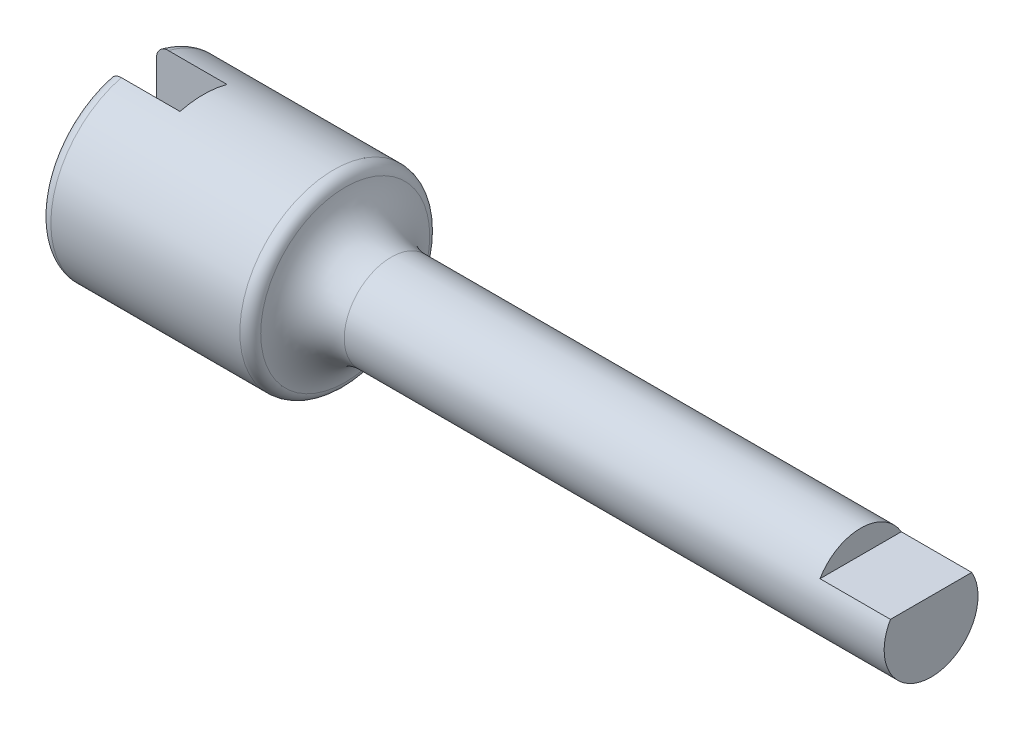
ISO-10303-21;
HEADER;
FILE_DESCRIPTION(('STEP AP214'),'2;1');
FILE_NAME('part.step','',(''),(''),'','','');
FILE_SCHEMA(('AUTOMOTIVE_DESIGN { 1 0 10303 214 1 1 1 1 }'));
ENDSEC;
DATA;
#1=APPLICATION_CONTEXT('core data for automotive mechanical design processes');
#2=APPLICATION_PROTOCOL_DEFINITION('international standard','automotive_design',2000,#1);
#3=PRODUCT_CONTEXT('',#1,'mechanical');
#4=PRODUCT('Part','Part','',(#3));
#5=PRODUCT_RELATED_PRODUCT_CATEGORY('part','',(#4));
#6=PRODUCT_DEFINITION_FORMATION('','',#4);
#7=PRODUCT_DEFINITION_CONTEXT('part definition',#1,'design');
#8=PRODUCT_DEFINITION('design','',#6,#7);
#9=PRODUCT_DEFINITION_SHAPE('','',#8);
#10=(LENGTH_UNIT() NAMED_UNIT(*) SI_UNIT(.MILLI.,.METRE.));
#11=(NAMED_UNIT(*) PLANE_ANGLE_UNIT() SI_UNIT($,.RADIAN.));
#12=(NAMED_UNIT(*) SI_UNIT($,.STERADIAN.) SOLID_ANGLE_UNIT());
#13=UNCERTAINTY_MEASURE_WITH_UNIT(LENGTH_MEASURE(1.E-05),#10,'distance_accuracy_value','');
#14=(GEOMETRIC_REPRESENTATION_CONTEXT(3) GLOBAL_UNCERTAINTY_ASSIGNED_CONTEXT((#13)) GLOBAL_UNIT_ASSIGNED_CONTEXT((#10,
#11,#12)) REPRESENTATION_CONTEXT('',''));
#15=CARTESIAN_POINT('',(0.,0.,0.));
#16=DIRECTION('',(0.,0.,1.));
#17=DIRECTION('',(1.,0.,0.));
#18=AXIS2_PLACEMENT_3D('',#15,#16,#17);
#19=CARTESIAN_POINT('',(0.,0.,0.));
#20=DIRECTION('',(1.,0.,0.));
#21=DIRECTION('',(0.,0.,-1.));
#22=AXIS2_PLACEMENT_3D('',#19,#20,#21);
#23=PLANE('',#22);
#24=DIRECTION('',(0.,1.,0.));
#25=VECTOR('',#24,1.);
#26=CARTESIAN_POINT('',(0.,0.,-1.));
#27=LINE('',#26,#25);
#28=CARTESIAN_POINT('',(0.,-3.35410196624968,-1.));
#29=VERTEX_POINT('',#28);
#30=CARTESIAN_POINT('',(0.,3.35410196624968,-1.));
#31=VERTEX_POINT('',#30);
#32=EDGE_CURVE('E117',#29,#31,#27,.T.);
#33=ORIENTED_EDGE('',*,*,#32,.T.);
#34=CARTESIAN_POINT('',(0.,0.,0.));
#35=DIRECTION('',(1.,0.,0.));
#36=DIRECTION('',(0.,0.,-1.));
#37=AXIS2_PLACEMENT_3D('',#34,#35,#36);
#38=CIRCLE('',#37,3.5);
#39=EDGE_CURVE('E183',#31,#29,#38,.F.);
#40=ORIENTED_EDGE('',*,*,#39,.T.);
#41=EDGE_LOOP('',(#33,#40));
#42=FACE_BOUND('',#41,.T.);
#43=ADVANCED_FACE('F31',(#42),#23,.F.);
#44=CARTESIAN_POINT('',(34.,2.,0.));
#45=DIRECTION('',(-1.,0.,0.));
#46=DIRECTION('',(0.,0.,1.));
#47=AXIS2_PLACEMENT_3D('',#44,#45,#46);
#48=PLANE('',#47);
#49=CARTESIAN_POINT('',(34.,0.,0.));
#50=DIRECTION('',(-1.,0.,0.));
#51=DIRECTION('',(0.,0.,1.));
#52=AXIS2_PLACEMENT_3D('',#49,#50,#51);
#53=CIRCLE('',#52,2.);
#54=CARTESIAN_POINT('',(34.,0.999999999999997,-1.73205080756888));
#55=VERTEX_POINT('',#54);
#56=CARTESIAN_POINT('',(34.,0.999999999999997,1.73205080756888));
#57=VERTEX_POINT('',#56);
#58=EDGE_CURVE('E111',#55,#57,#53,.T.);
#59=ORIENTED_EDGE('',*,*,#58,.F.);
#60=DIRECTION('',(0.,0.,1.));
#61=VECTOR('',#60,1.);
#62=CARTESIAN_POINT('',(34.,0.999999999999997,-4.));
#63=LINE('',#62,#61);
#64=EDGE_CURVE('E106',#55,#57,#63,.T.);
#65=ORIENTED_EDGE('',*,*,#64,.T.);
#66=EDGE_LOOP('',(#59,#65));
#67=FACE_BOUND('',#66,.T.);
#68=ADVANCED_FACE('F214',(#67),#48,.F.);
#69=CARTESIAN_POINT('',(0.,0.,0.));
#70=DIRECTION('',(-1.,0.,0.));
#71=DIRECTION('',(0.,0.,1.));
#72=AXIS2_PLACEMENT_3D('',#69,#70,#71);
#73=CYLINDRICAL_SURFACE('',#72,2.);
#74=CARTESIAN_POINT('',(11.,0.,0.));
#75=DIRECTION('',(-1.,0.,0.));
#76=DIRECTION('',(0.,0.,1.));
#77=AXIS2_PLACEMENT_3D('',#74,#75,#76);
#78=CIRCLE('',#77,2.);
#79=CARTESIAN_POINT('',(11.,0.,2.));
#80=VERTEX_POINT('',#79);
#81=EDGE_CURVE('E114',#80,#80,#78,.T.);
#82=ORIENTED_EDGE('',*,*,#81,.F.);
#83=EDGE_LOOP('',(#82));
#84=FACE_BOUND('',#83,.T.);
#85=ORIENTED_EDGE('',*,*,#58,.T.);
#86=DIRECTION('',(-1.,0.,0.));
#87=VECTOR('',#86,1.);
#88=CARTESIAN_POINT('',(0.,0.999999999999992,1.73205080756888));
#89=LINE('',#88,#87);
#90=CARTESIAN_POINT('',(31.,0.999999999999996,1.73205080756888));
#91=VERTEX_POINT('',#90);
#92=EDGE_CURVE('E11',#57,#91,#89,.T.);
#93=ORIENTED_EDGE('',*,*,#92,.T.);
#94=CARTESIAN_POINT('',(31.,0.,0.));
#95=DIRECTION('',(-1.,0.,0.));
#96=DIRECTION('',(0.,0.,1.));
#97=AXIS2_PLACEMENT_3D('',#94,#95,#96);
#98=CIRCLE('',#97,2.);
#99=CARTESIAN_POINT('',(31.,0.999999999999996,-1.73205080756888));
#100=VERTEX_POINT('',#99);
#101=EDGE_CURVE('E97',#91,#100,#98,.T.);
#102=ORIENTED_EDGE('',*,*,#101,.T.);
#103=DIRECTION('',(-1.,0.,0.));
#104=VECTOR('',#103,1.);
#105=CARTESIAN_POINT('',(0.,0.999999999999992,-1.73205080756888));
#106=LINE('',#105,#104);
#107=EDGE_CURVE('E40',#100,#55,#106,.F.);
#108=ORIENTED_EDGE('',*,*,#107,.T.);
#109=EDGE_LOOP('',(#85,#93,#102,#108));
#110=FACE_BOUND('',#109,.T.);
#111=ADVANCED_FACE('F109',(#84,#110),#73,.T.);
#112=CARTESIAN_POINT('',(11.,0.,0.));
#113=DIRECTION('',(-1.,0.,0.));
#114=DIRECTION('',(0.,0.,1.));
#115=AXIS2_PLACEMENT_3D('',#112,#113,#114);
#116=TOROIDAL_SURFACE('',#115,4.,2.);
#117=CARTESIAN_POINT('',(9.04040820577345,0.,0.));
#118=DIRECTION('',(1.,0.,0.));
#119=DIRECTION('',(0.,0.,-1.));
#120=AXIS2_PLACEMENT_3D('',#117,#118,#119);
#121=CIRCLE('',#120,3.6);
#122=CARTESIAN_POINT('',(9.04040820577345,0.,-3.6));
#123=VERTEX_POINT('',#122);
#124=EDGE_CURVE('E136',#123,#123,#121,.T.);
#125=ORIENTED_EDGE('',*,*,#124,.T.);
#126=EDGE_LOOP('',(#125));
#127=FACE_BOUND('',#126,.T.);
#128=ORIENTED_EDGE('',*,*,#81,.T.);
#129=EDGE_LOOP('',(#128));
#130=FACE_BOUND('',#129,.T.);
#131=ADVANCED_FACE('F211',(#127,#130),#116,.F.);
#132=CARTESIAN_POINT('',(0.,0.,0.));
#133=DIRECTION('',(-1.,0.,0.));
#134=DIRECTION('',(0.,0.,1.));
#135=AXIS2_PLACEMENT_3D('',#132,#133,#134);
#136=CYLINDRICAL_SURFACE('',#135,4.);
#137=CARTESIAN_POINT('',(8.55051025721682,0.,0.));
#138=DIRECTION('',(1.,0.,0.));
#139=DIRECTION('',(0.,0.,-1.));
#140=AXIS2_PLACEMENT_3D('',#137,#138,#139);
#141=CIRCLE('',#140,4.);
#142=CARTESIAN_POINT('',(8.55051025721682,0.,-4.));
#143=VERTEX_POINT('',#142);
#144=EDGE_CURVE('E133',#143,#143,#141,.F.);
#145=ORIENTED_EDGE('',*,*,#144,.T.);
#146=EDGE_LOOP('',(#145));
#147=FACE_BOUND('',#146,.T.);
#148=DIRECTION('',(-1.,0.,0.));
#149=VECTOR('',#148,1.);
#150=CARTESIAN_POINT('',(0.,3.87298334620741,1.));
#151=LINE('',#150,#149);
#152=CARTESIAN_POINT('',(3.,3.87298334620741,1.));
#153=VERTEX_POINT('',#152);
#154=CARTESIAN_POINT('',(0.5,3.87298334620741,1.));
#155=VERTEX_POINT('',#154);
#156=EDGE_CURVE('E191',#153,#155,#151,.T.);
#157=ORIENTED_EDGE('',*,*,#156,.T.);
#158=CARTESIAN_POINT('',(0.5,0.,0.));
#159=DIRECTION('',(1.,0.,0.));
#160=DIRECTION('',(0.,0.,-1.));
#161=AXIS2_PLACEMENT_3D('',#158,#159,#160);
#162=CIRCLE('',#161,4.);
#163=CARTESIAN_POINT('',(0.5,-3.87298334620741,1.));
#164=VERTEX_POINT('',#163);
#165=EDGE_CURVE('E131',#155,#164,#162,.T.);
#166=ORIENTED_EDGE('',*,*,#165,.T.);
#167=DIRECTION('',(-1.,0.,0.));
#168=VECTOR('',#167,1.);
#169=CARTESIAN_POINT('',(0.,-3.87298334620741,1.));
#170=LINE('',#169,#168);
#171=CARTESIAN_POINT('',(3.,-3.87298334620741,1.));
#172=VERTEX_POINT('',#171);
#173=EDGE_CURVE('E201',#164,#172,#170,.F.);
#174=ORIENTED_EDGE('',*,*,#173,.T.);
#175=CARTESIAN_POINT('',(3.,0.,0.));
#176=DIRECTION('',(-1.,0.,0.));
#177=DIRECTION('',(0.,0.,1.));
#178=AXIS2_PLACEMENT_3D('',#175,#176,#177);
#179=CIRCLE('',#178,4.);
#180=CARTESIAN_POINT('',(3.,-3.87298334620741,-1.));
#181=VERTEX_POINT('',#180);
#182=EDGE_CURVE('E125',#181,#172,#179,.T.);
#183=ORIENTED_EDGE('',*,*,#182,.F.);
#184=DIRECTION('',(-1.,0.,0.));
#185=VECTOR('',#184,1.);
#186=CARTESIAN_POINT('',(0.,-3.87298334620741,-1.));
#187=LINE('',#186,#185);
#188=CARTESIAN_POINT('',(0.5,-3.87298334620741,-1.));
#189=VERTEX_POINT('',#188);
#190=EDGE_CURVE('E120',#181,#189,#187,.T.);
#191=ORIENTED_EDGE('',*,*,#190,.T.);
#192=CARTESIAN_POINT('',(0.5,0.,0.));
#193=DIRECTION('',(1.,0.,0.));
#194=DIRECTION('',(0.,0.,-1.));
#195=AXIS2_PLACEMENT_3D('',#192,#193,#194);
#196=CIRCLE('',#195,4.);
#197=CARTESIAN_POINT('',(0.5,3.87298334620741,-1.));
#198=VERTEX_POINT('',#197);
#199=EDGE_CURVE('E129',#189,#198,#196,.T.);
#200=ORIENTED_EDGE('',*,*,#199,.T.);
#201=DIRECTION('',(-1.,0.,0.));
#202=VECTOR('',#201,1.);
#203=CARTESIAN_POINT('',(0.,3.87298334620741,-1.));
#204=LINE('',#203,#202);
#205=CARTESIAN_POINT('',(3.,3.87298334620741,-1.));
#206=VERTEX_POINT('',#205);
#207=EDGE_CURVE('E200',#198,#206,#204,.F.);
#208=ORIENTED_EDGE('',*,*,#207,.T.);
#209=EDGE_CURVE('E128',#153,#206,#179,.T.);
#210=ORIENTED_EDGE('',*,*,#209,.F.);
#211=EDGE_LOOP('',(#157,#166,#174,#183,#191,#200,#208,#210));
#212=FACE_BOUND('',#211,.T.);
#213=ADVANCED_FACE('F197',(#147,#212),#136,.T.);
#214=DIRECTION('',(0.,-1.,0.));
#215=VECTOR('',#214,1.);
#216=CARTESIAN_POINT('',(0.,0.,1.));
#217=LINE('',#216,#215);
#218=CARTESIAN_POINT('',(0.,3.35410196624968,1.));
#219=VERTEX_POINT('',#218);
#220=CARTESIAN_POINT('',(0.,-3.35410196624968,1.));
#221=VERTEX_POINT('',#220);
#222=EDGE_CURVE('E113',#219,#221,#217,.T.);
#223=ORIENTED_EDGE('',*,*,#222,.T.);
#224=CARTESIAN_POINT('',(0.,0.,0.));
#225=DIRECTION('',(1.,0.,0.));
#226=DIRECTION('',(0.,0.,-1.));
#227=AXIS2_PLACEMENT_3D('',#224,#225,#226);
#228=CIRCLE('',#227,3.5);
#229=EDGE_CURVE('E139',#221,#219,#228,.F.);
#230=ORIENTED_EDGE('',*,*,#229,.T.);
#231=EDGE_LOOP('',(#223,#230));
#232=FACE_BOUND('',#231,.T.);
#233=ADVANCED_FACE('F170',(#232),#23,.F.);
#234=CARTESIAN_POINT('',(3.,-4.,-1.));
#235=DIRECTION('',(-1.,0.,0.));
#236=DIRECTION('',(0.,0.,1.));
#237=AXIS2_PLACEMENT_3D('',#234,#235,#236);
#238=PLANE('',#237);
#239=DIRECTION('',(0.,1.,0.));
#240=VECTOR('',#239,1.);
#241=CARTESIAN_POINT('',(3.,4.,1.));
#242=LINE('',#241,#240);
#243=EDGE_CURVE('E227',#172,#153,#242,.T.);
#244=ORIENTED_EDGE('',*,*,#243,.T.);
#245=ORIENTED_EDGE('',*,*,#209,.T.);
#246=DIRECTION('',(0.,-1.,0.));
#247=VECTOR('',#246,1.);
#248=CARTESIAN_POINT('',(3.,4.,-1.));
#249=LINE('',#248,#247);
#250=EDGE_CURVE('E223',#206,#181,#249,.T.);
#251=ORIENTED_EDGE('',*,*,#250,.T.);
#252=ORIENTED_EDGE('',*,*,#182,.T.);
#253=EDGE_LOOP('',(#244,#245,#251,#252));
#254=FACE_BOUND('',#253,.T.);
#255=ADVANCED_FACE('F164',(#254),#238,.T.);
#256=CARTESIAN_POINT('',(3.,4.,-1.));
#257=DIRECTION('',(0.,0.,-1.));
#258=DIRECTION('',(-1.,0.,0.));
#259=AXIS2_PLACEMENT_3D('',#256,#257,#258);
#260=PLANE('',#259);
#261=ORIENTED_EDGE('',*,*,#32,.F.);
#262=CARTESIAN_POINT('',(0.,-3.35410196624968,-1.));
#263=CARTESIAN_POINT('',(-2.13092428744003E-05,-3.38418548637136,-1.));
#264=CARTESIAN_POINT('',(0.00249247974888768,-3.4142737782148,-1.));
#265=CARTESIAN_POINT('',(0.012480055571948,-3.47363486188561,-1.));
#266=CARTESIAN_POINT('',(0.0199570567085773,-3.50290711241373,-1.));
#267=CARTESIAN_POINT('',(0.0397718196631161,-3.5598021093625,-1.));
#268=CARTESIAN_POINT('',(0.0521150827156247,-3.58742294804652,-1.));
#269=CARTESIAN_POINT('',(0.0813701557794196,-3.6401127632844,-1.));
#270=CARTESIAN_POINT('',(0.0982790493108325,-3.66518335488425,-1.));
#271=CARTESIAN_POINT('',(0.135772512647409,-3.71139831560556,-1.));
#272=CARTESIAN_POINT('',(0.156257247909048,-3.73262360725588,-1.));
#273=CARTESIAN_POINT('',(0.200623805323817,-3.77118383729958,-1.));
#274=CARTESIAN_POINT('',(0.224506072100781,-3.78851826574185,-1.));
#275=CARTESIAN_POINT('',(0.27406308494646,-3.81814622069009,-1.));
#276=CARTESIAN_POINT('',(0.299644044694387,-3.83059691431006,-1.));
#277=CARTESIAN_POINT('',(0.352563297701962,-3.85087696285542,-1.));
#278=CARTESIAN_POINT('',(0.379899650117796,-3.8587113274697,-1.));
#279=CARTESIAN_POINT('',(0.422896846101195,-3.86705768130638,-1.));
#280=CARTESIAN_POINT('',(0.438244714731271,-3.86927888982848,-1.));
#281=CARTESIAN_POINT('',(0.469059173535766,-3.87224096667676,-1.));
#282=CARTESIAN_POINT('',(0.484525549034742,-3.87298406892238,-1.));
#283=CARTESIAN_POINT('',(0.499999999999891,-3.87298334620798,-1.));
#284=B_SPLINE_CURVE_WITH_KNOTS('',3,(#262,#263,#264,#265,#266,#267,#268,#269,#270,#271,#272,
#273,#274,#275,#276,#277,#278,#279,#280,#281,#282,#283),.UNSPECIFIED.,.F.,.F.,(4,2,2,2,2,2,2,2,
2,2,4),(0.,0.0901539643923148,0.180366371875888,0.270681056894825,0.360938185711276,
0.448991413085654,0.53705617431623,0.621993230940279,0.706837942402146,0.753297868169402,
0.799687523732185),.UNSPECIFIED.);
#285=EDGE_CURVE('E101',#29,#189,#284,.T.);
#286=ORIENTED_EDGE('',*,*,#285,.T.);
#287=ORIENTED_EDGE('',*,*,#190,.F.);
#288=ORIENTED_EDGE('',*,*,#250,.F.);
#289=ORIENTED_EDGE('',*,*,#207,.F.);
#290=CARTESIAN_POINT('',(0.5,3.87298334620741,-1.));
#291=CARTESIAN_POINT('',(0.47254093813689,3.87301045346171,-1.));
#292=CARTESIAN_POINT('',(0.44509363797332,3.87064893853128,-1.));
#293=CARTESIAN_POINT('',(0.391027961495371,3.86135414862879,-1.));
#294=CARTESIAN_POINT('',(0.364408324172766,3.85442822539187,-1.));
#295=CARTESIAN_POINT('',(0.312704962873397,3.83620704568781,-1.));
#296=CARTESIAN_POINT('',(0.287621553900305,3.82491089655711,-1.));
#297=CARTESIAN_POINT('',(0.239675121742526,3.7983203366846,-1.));
#298=CARTESIAN_POINT('',(0.216812212738858,3.78302572048551,-1.));
#299=CARTESIAN_POINT('',(0.173627083913547,3.74869310383485,-1.));
#300=CARTESIAN_POINT('',(0.153340238881398,3.72961065352219,-1.));
#301=CARTESIAN_POINT('',(0.116142125052879,3.68839835212666,-1.));
#302=CARTESIAN_POINT('',(0.0992315409996142,3.66626788440691,-1.));
#303=CARTESIAN_POINT('',(0.0687120518278707,3.61887905024689,-1.));
#304=CARTESIAN_POINT('',(0.0552192475630359,3.59354600591834,-1.));
#305=CARTESIAN_POINT('',(0.0325148001314908,3.54102813285445,-1.));
#306=CARTESIAN_POINT('',(0.023303192936569,3.51384328856199,-1.));
#307=CARTESIAN_POINT('',(0.0108870700132621,3.46453652022991,-1.));
#308=CARTESIAN_POINT('',(0.00680281582625732,3.44263095073152,-1.));
#309=CARTESIAN_POINT('',(0.00135927635922273,3.39851877906654,-1.));
#310=CARTESIAN_POINT('',(-4.31946675410877E-06,3.3763127093049,-1.));
#311=CARTESIAN_POINT('',(0.,3.35410196624968,-1.));
#312=B_SPLINE_CURVE_WITH_KNOTS('',3,(#290,#291,#292,#293,#294,#295,#296,#297,#298,#299,#300,
#301,#302,#303,#304,#305,#306,#307,#308,#309,#310,#311),.UNSPECIFIED.,.F.,.F.,(4,2,2,2,2,2,2,2,
2,2,4),(0.,0.0822580855875561,0.164384003658814,0.246526705657237,0.328673629307262,
0.411848546659553,0.49504031570854,0.580763068929069,0.66648654240259,0.733172739753368,
0.799753196922599),.UNSPECIFIED.);
#313=EDGE_CURVE('E54',#198,#31,#312,.T.);
#314=ORIENTED_EDGE('',*,*,#313,.T.);
#315=EDGE_LOOP('',(#261,#286,#287,#288,#289,#314));
#316=FACE_BOUND('',#315,.T.);
#317=ADVANCED_FACE('F162',(#316),#260,.F.);
#318=CARTESIAN_POINT('',(3.,4.,1.));
#319=DIRECTION('',(0.,0.,1.));
#320=DIRECTION('',(0.,-1.,0.));
#321=AXIS2_PLACEMENT_3D('',#318,#319,#320);
#322=PLANE('',#321);
#323=ORIENTED_EDGE('',*,*,#222,.F.);
#324=CARTESIAN_POINT('',(0.,3.35410196624968,1.));
#325=CARTESIAN_POINT('',(-2.13092428742936E-05,3.38418548637136,1.));
#326=CARTESIAN_POINT('',(0.00249247974888779,3.4142737782148,1.));
#327=CARTESIAN_POINT('',(0.0124800555719481,3.47363486188561,1.));
#328=CARTESIAN_POINT('',(0.0199570567085773,3.50290711241373,1.));
#329=CARTESIAN_POINT('',(0.0397718196631161,3.5598021093625,1.));
#330=CARTESIAN_POINT('',(0.0521150827156247,3.58742294804652,1.));
#331=CARTESIAN_POINT('',(0.0813701557794195,3.6401127632844,1.));
#332=CARTESIAN_POINT('',(0.0982790493108325,3.66518335488425,1.));
#333=CARTESIAN_POINT('',(0.135772512647408,3.71139831560556,1.));
#334=CARTESIAN_POINT('',(0.156257247909047,3.73262360725588,1.));
#335=CARTESIAN_POINT('',(0.200623805323816,3.77118383729958,1.));
#336=CARTESIAN_POINT('',(0.224506072100781,3.78851826574185,1.));
#337=CARTESIAN_POINT('',(0.27406308494646,3.81814622069009,1.));
#338=CARTESIAN_POINT('',(0.299644044694386,3.83059691431006,1.));
#339=CARTESIAN_POINT('',(0.352563297701962,3.85087696285542,1.));
#340=CARTESIAN_POINT('',(0.379899650117796,3.8587113274697,1.));
#341=CARTESIAN_POINT('',(0.422896846101195,3.86705768130638,1.));
#342=CARTESIAN_POINT('',(0.43824471473127,3.86927888982848,1.));
#343=CARTESIAN_POINT('',(0.469059173535766,3.87224096667676,1.));
#344=CARTESIAN_POINT('',(0.484525549034742,3.87298406892238,1.));
#345=CARTESIAN_POINT('',(0.499999999999891,3.87298334620798,1.));
#346=B_SPLINE_CURVE_WITH_KNOTS('',3,(#324,#325,#326,#327,#328,#329,#330,#331,#332,#333,#334,
#335,#336,#337,#338,#339,#340,#341,#342,#343,#344,#345),.UNSPECIFIED.,.F.,.F.,(4,2,2,2,2,2,2,2,
2,2,4),(0.,0.0901539643923148,0.180366371875888,0.270681056894825,0.360938185711276,
0.448991413085653,0.53705617431623,0.621993230940279,0.706837942402145,0.753297868169402,
0.799687523732185),.UNSPECIFIED.);
#347=EDGE_CURVE('E148',#219,#155,#346,.T.);
#348=ORIENTED_EDGE('',*,*,#347,.T.);
#349=ORIENTED_EDGE('',*,*,#156,.F.);
#350=ORIENTED_EDGE('',*,*,#243,.F.);
#351=ORIENTED_EDGE('',*,*,#173,.F.);
#352=CARTESIAN_POINT('',(0.5,-3.87298334620741,1.));
#353=CARTESIAN_POINT('',(0.47254093813689,-3.87301045346171,1.));
#354=CARTESIAN_POINT('',(0.44509363797332,-3.87064893853128,1.));
#355=CARTESIAN_POINT('',(0.391027961495371,-3.86135414862879,1.));
#356=CARTESIAN_POINT('',(0.364408324172766,-3.85442822539187,1.));
#357=CARTESIAN_POINT('',(0.312704962873397,-3.83620704568781,1.));
#358=CARTESIAN_POINT('',(0.287621553900305,-3.82491089655711,1.));
#359=CARTESIAN_POINT('',(0.239675121742526,-3.7983203366846,1.));
#360=CARTESIAN_POINT('',(0.216812212738858,-3.78302572048551,1.));
#361=CARTESIAN_POINT('',(0.173627083913547,-3.74869310383485,1.));
#362=CARTESIAN_POINT('',(0.153340238881398,-3.72961065352219,1.));
#363=CARTESIAN_POINT('',(0.116142125052879,-3.68839835212666,1.));
#364=CARTESIAN_POINT('',(0.0992315409996142,-3.66626788440691,1.));
#365=CARTESIAN_POINT('',(0.0687120518278707,-3.61887905024689,1.));
#366=CARTESIAN_POINT('',(0.0552192475630358,-3.59354600591834,1.));
#367=CARTESIAN_POINT('',(0.0325148001314907,-3.54102813285445,1.));
#368=CARTESIAN_POINT('',(0.023303192936569,-3.51384328856199,1.));
#369=CARTESIAN_POINT('',(0.0108870700132621,-3.46453652022991,1.));
#370=CARTESIAN_POINT('',(0.00680281582625733,-3.44263095073152,1.));
#371=CARTESIAN_POINT('',(0.00135927635922272,-3.39851877906654,1.));
#372=CARTESIAN_POINT('',(-4.31946675412443E-06,-3.3763127093049,1.));
#373=CARTESIAN_POINT('',(0.,-3.35410196624968,1.));
#374=B_SPLINE_CURVE_WITH_KNOTS('',3,(#352,#353,#354,#355,#356,#357,#358,#359,#360,#361,#362,
#363,#364,#365,#366,#367,#368,#369,#370,#371,#372,#373),.UNSPECIFIED.,.F.,.F.,(4,2,2,2,2,2,2,2,
2,2,4),(0.,0.0822580855875561,0.164384003658814,0.246526705657237,0.328673629307262,
0.411848546659553,0.49504031570854,0.580763068929069,0.66648654240259,0.733172739753368,
0.799753196922599),.UNSPECIFIED.);
#375=EDGE_CURVE('E142',#164,#221,#374,.T.);
#376=ORIENTED_EDGE('',*,*,#375,.T.);
#377=EDGE_LOOP('',(#323,#348,#349,#350,#351,#376));
#378=FACE_BOUND('',#377,.T.);
#379=ADVANCED_FACE('F156',(#378),#322,.F.);
#380=CARTESIAN_POINT('',(8.55051025721682,0.,0.));
#381=DIRECTION('',(1.,0.,0.));
#382=DIRECTION('',(0.,0.,-1.));
#383=AXIS2_PLACEMENT_3D('',#380,#381,#382);
#384=TOROIDAL_SURFACE('',#383,3.5,0.5);
#385=ORIENTED_EDGE('',*,*,#124,.F.);
#386=EDGE_LOOP('',(#385));
#387=FACE_BOUND('',#386,.T.);
#388=ORIENTED_EDGE('',*,*,#144,.F.);
#389=EDGE_LOOP('',(#388));
#390=FACE_BOUND('',#389,.T.);
#391=ADVANCED_FACE('F161',(#387,#390),#384,.T.);
#392=CARTESIAN_POINT('',(0.5,0.,0.));
#393=DIRECTION('',(1.,0.,0.));
#394=DIRECTION('',(0.,0.,-1.));
#395=AXIS2_PLACEMENT_3D('',#392,#393,#394);
#396=TOROIDAL_SURFACE('',#395,3.5,0.5);
#397=ORIENTED_EDGE('',*,*,#375,.F.);
#398=ORIENTED_EDGE('',*,*,#165,.F.);
#399=ORIENTED_EDGE('',*,*,#347,.F.);
#400=ORIENTED_EDGE('',*,*,#229,.F.);
#401=EDGE_LOOP('',(#397,#398,#399,#400));
#402=FACE_BOUND('',#401,.T.);
#403=ADVANCED_FACE('F153',(#402),#396,.T.);
#404=CARTESIAN_POINT('',(0.5,0.,0.));
#405=DIRECTION('',(1.,0.,0.));
#406=DIRECTION('',(0.,0.,-1.));
#407=AXIS2_PLACEMENT_3D('',#404,#405,#406);
#408=TOROIDAL_SURFACE('',#407,3.5,0.5);
#409=ORIENTED_EDGE('',*,*,#313,.F.);
#410=ORIENTED_EDGE('',*,*,#199,.F.);
#411=ORIENTED_EDGE('',*,*,#285,.F.);
#412=ORIENTED_EDGE('',*,*,#39,.F.);
#413=EDGE_LOOP('',(#409,#410,#411,#412));
#414=FACE_BOUND('',#413,.T.);
#415=ADVANCED_FACE('F33',(#414),#408,.T.);
#416=CARTESIAN_POINT('',(34.,0.999999999999997,-4.));
#417=DIRECTION('',(0.,-1.,0.));
#418=DIRECTION('',(1.,0.,0.));
#419=AXIS2_PLACEMENT_3D('',#416,#417,#418);
#420=PLANE('',#419);
#421=ORIENTED_EDGE('',*,*,#64,.F.);
#422=ORIENTED_EDGE('',*,*,#107,.F.);
#423=DIRECTION('',(0.,0.,1.));
#424=VECTOR('',#423,1.);
#425=CARTESIAN_POINT('',(31.,0.999999999999996,-4.));
#426=LINE('',#425,#424);
#427=EDGE_CURVE('E46',#100,#91,#426,.T.);
#428=ORIENTED_EDGE('',*,*,#427,.T.);
#429=ORIENTED_EDGE('',*,*,#92,.F.);
#430=EDGE_LOOP('',(#421,#422,#428,#429));
#431=FACE_BOUND('',#430,.T.);
#432=ADVANCED_FACE('F104',(#431),#420,.F.);
#433=CARTESIAN_POINT('',(31.,2.,-4.));
#434=DIRECTION('',(-1.,0.,0.));
#435=DIRECTION('',(0.,0.,1.));
#436=AXIS2_PLACEMENT_3D('',#433,#434,#435);
#437=PLANE('',#436);
#438=ORIENTED_EDGE('',*,*,#427,.F.);
#439=ORIENTED_EDGE('',*,*,#101,.F.);
#440=EDGE_LOOP('',(#438,#439));
#441=FACE_BOUND('',#440,.T.);
#442=ADVANCED_FACE('F98',(#441),#437,.F.);
#443=CLOSED_SHELL('',(#43,#68,#111,#131,#213,#233,#255,#317,#379,#391,#403,#415,#432,#442));
#444=MANIFOLD_SOLID_BREP('B2',#443);
#445=ADVANCED_BREP_SHAPE_REPRESENTATION('',(#18,#444),#14);
#446=SHAPE_DEFINITION_REPRESENTATION(#9,#445);
ENDSEC;
END-ISO-10303-21;
